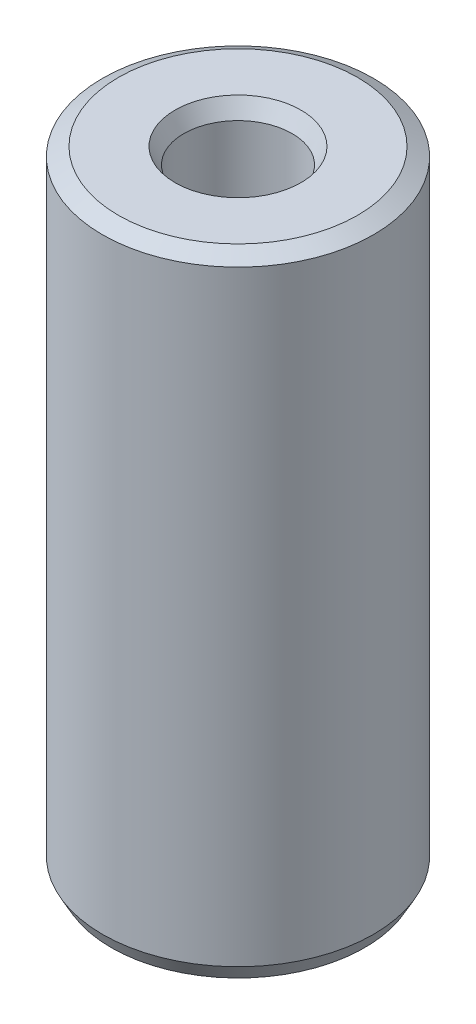
ISO-10303-21;
HEADER;
FILE_DESCRIPTION(('STEP AP214'),'2;1');
FILE_NAME('part.step','',(''),(''),'','','');
FILE_SCHEMA(('AUTOMOTIVE_DESIGN { 1 0 10303 214 1 1 1 1 }'));
ENDSEC;
DATA;
#1=APPLICATION_CONTEXT('core data for automotive mechanical design processes');
#2=APPLICATION_PROTOCOL_DEFINITION('international standard','automotive_design',2000,#1);
#3=PRODUCT_CONTEXT('',#1,'mechanical');
#4=PRODUCT('Part','Part','',(#3));
#5=PRODUCT_RELATED_PRODUCT_CATEGORY('part','',(#4));
#6=PRODUCT_DEFINITION_FORMATION('','',#4);
#7=PRODUCT_DEFINITION_CONTEXT('part definition',#1,'design');
#8=PRODUCT_DEFINITION('design','',#6,#7);
#9=PRODUCT_DEFINITION_SHAPE('','',#8);
#10=(LENGTH_UNIT() NAMED_UNIT(*) SI_UNIT(.MILLI.,.METRE.));
#11=(NAMED_UNIT(*) PLANE_ANGLE_UNIT() SI_UNIT($,.RADIAN.));
#12=(NAMED_UNIT(*) SI_UNIT($,.STERADIAN.) SOLID_ANGLE_UNIT());
#13=UNCERTAINTY_MEASURE_WITH_UNIT(LENGTH_MEASURE(1.E-05),#10,'distance_accuracy_value','');
#14=(GEOMETRIC_REPRESENTATION_CONTEXT(3) GLOBAL_UNCERTAINTY_ASSIGNED_CONTEXT((#13)) GLOBAL_UNIT_ASSIGNED_CONTEXT((#10,
#11,#12)) REPRESENTATION_CONTEXT('',''));
#15=CARTESIAN_POINT('',(0.,0.,0.));
#16=DIRECTION('',(0.,0.,1.));
#17=DIRECTION('',(1.,0.,0.));
#18=AXIS2_PLACEMENT_3D('',#15,#16,#17);
#19=CARTESIAN_POINT('',(0.,93.0772227262,0.));
#20=DIRECTION('',(0.,-1.,0.));
#21=DIRECTION('',(0.,0.,-1.));
#22=AXIS2_PLACEMENT_3D('',#19,#20,#21);
#23=CYLINDRICAL_SURFACE('',#22,20.);
#24=CARTESIAN_POINT('',(0.,2.35783132583067,0.));
#25=DIRECTION('',(0.,1.,0.));
#26=DIRECTION('',(0.,0.,1.));
#27=AXIS2_PLACEMENT_3D('',#24,#25,#26);
#28=CIRCLE('',#27,20.);
#29=CARTESIAN_POINT('',(0.,2.35783132583067,20.));
#30=VERTEX_POINT('',#29);
#31=EDGE_CURVE('E10',#30,#30,#28,.T.);
#32=ORIENTED_EDGE('',*,*,#31,.T.);
#33=EDGE_LOOP('',(#32));
#34=FACE_BOUND('',#33,.T.);
#35=CARTESIAN_POINT('',(0.,91.7779759956673,0.));
#36=DIRECTION('',(0.,1.,0.));
#37=DIRECTION('',(0.,0.,1.));
#38=AXIS2_PLACEMENT_3D('',#35,#36,#37);
#39=CIRCLE('',#38,20.);
#40=CARTESIAN_POINT('',(0.,91.7779759956673,20.));
#41=VERTEX_POINT('',#40);
#42=EDGE_CURVE('E50',#41,#41,#39,.F.);
#43=ORIENTED_EDGE('',*,*,#42,.T.);
#44=EDGE_LOOP('',(#43));
#45=FACE_BOUND('',#44,.T.);
#46=ADVANCED_FACE('F39',(#34,#45),#23,.T.);
#47=CARTESIAN_POINT('',(0.,93.0772227262,0.));
#48=DIRECTION('',(0.,1.,0.));
#49=DIRECTION('',(0.,0.,1.));
#50=AXIS2_PLACEMENT_3D('',#47,#48,#49);
#51=PLANE('',#50);
#52=CARTESIAN_POINT('',(0.,93.0772227262,0.));
#53=DIRECTION('',(0.,1.,0.));
#54=DIRECTION('',(0.,0.,1.));
#55=AXIS2_PLACEMENT_3D('',#52,#53,#54);
#56=CIRCLE('',#55,9.290536503323);
#57=CARTESIAN_POINT('',(0.,93.0772227262,9.290536503323));
#58=VERTEX_POINT('',#57);
#59=EDGE_CURVE('E58',#58,#58,#56,.F.);
#60=ORIENTED_EDGE('',*,*,#59,.T.);
#61=EDGE_LOOP('',(#60));
#62=FACE_BOUND('',#61,.T.);
#63=CARTESIAN_POINT('',(0.,93.0772227262,0.));
#64=DIRECTION('',(0.,1.,0.));
#65=DIRECTION('',(0.,0.,1.));
#66=AXIS2_PLACEMENT_3D('',#63,#64,#65);
#67=CIRCLE('',#66,17.6421686741694);
#68=CARTESIAN_POINT('',(0.,93.0772227262,17.6421686741694));
#69=VERTEX_POINT('',#68);
#70=EDGE_CURVE('E61',#69,#69,#67,.T.);
#71=ORIENTED_EDGE('',*,*,#70,.T.);
#72=EDGE_LOOP('',(#71));
#73=FACE_BOUND('',#72,.T.);
#74=ADVANCED_FACE('F88',(#62,#73),#51,.T.);
#75=CARTESIAN_POINT('',(0.,0.,0.));
#76=DIRECTION('',(0.,1.,0.));
#77=DIRECTION('',(0.,0.,1.));
#78=AXIS2_PLACEMENT_3D('',#75,#76,#77);
#79=PLANE('',#78);
#80=CARTESIAN_POINT('',(0.,0.,0.));
#81=DIRECTION('',(0.,1.,0.));
#82=DIRECTION('',(0.,0.,1.));
#83=AXIS2_PLACEMENT_3D('',#80,#81,#82);
#84=CIRCLE('',#83,10.3491210986209);
#85=CARTESIAN_POINT('',(0.,0.,-10.3491210986209));
#86=VERTEX_POINT('',#85);
#87=EDGE_CURVE('E51',#86,#86,#84,.T.);
#88=ORIENTED_EDGE('',*,*,#87,.T.);
#89=EDGE_LOOP('',(#88));
#90=FACE_BOUND('',#89,.T.);
#91=CARTESIAN_POINT('',(0.,0.,0.));
#92=DIRECTION('',(0.,1.,0.));
#93=DIRECTION('',(0.,0.,1.));
#94=AXIS2_PLACEMENT_3D('',#91,#92,#93);
#95=CIRCLE('',#94,18.7007532694673);
#96=CARTESIAN_POINT('',(0.,0.,18.7007532694673));
#97=VERTEX_POINT('',#96);
#98=EDGE_CURVE('E54',#97,#97,#95,.F.);
#99=ORIENTED_EDGE('',*,*,#98,.T.);
#100=EDGE_LOOP('',(#99));
#101=FACE_BOUND('',#100,.T.);
#102=ADVANCED_FACE('F83',(#90,#101),#79,.F.);
#103=CARTESIAN_POINT('',(0.,93.0772227262,0.));
#104=DIRECTION('',(0.,-1.,0.));
#105=DIRECTION('',(0.,0.,-1.));
#106=AXIS2_PLACEMENT_3D('',#103,#104,#105);
#107=CYLINDRICAL_SURFACE('',#106,7.99128977279031);
#108=CARTESIAN_POINT('',(0.,90.7193914003693,0.));
#109=DIRECTION('',(0.,1.,0.));
#110=DIRECTION('',(0.,0.,1.));
#111=AXIS2_PLACEMENT_3D('',#108,#109,#110);
#112=CIRCLE('',#111,7.99128977279031);
#113=CARTESIAN_POINT('',(0.,90.7193914003693,7.99128977279031));
#114=VERTEX_POINT('',#113);
#115=EDGE_CURVE('E67',#114,#114,#112,.T.);
#116=ORIENTED_EDGE('',*,*,#115,.T.);
#117=EDGE_LOOP('',(#116));
#118=FACE_BOUND('',#117,.T.);
#119=CARTESIAN_POINT('',(0.,1.29924673053269,0.));
#120=DIRECTION('',(0.,1.,0.));
#121=DIRECTION('',(0.,0.,1.));
#122=AXIS2_PLACEMENT_3D('',#119,#120,#121);
#123=CIRCLE('',#122,7.99128977279031);
#124=CARTESIAN_POINT('',(0.,1.29924673053269,-7.99128977279031));
#125=VERTEX_POINT('',#124);
#126=EDGE_CURVE('E69',#125,#125,#123,.F.);
#127=ORIENTED_EDGE('',*,*,#126,.T.);
#128=EDGE_LOOP('',(#127));
#129=FACE_BOUND('',#128,.T.);
#130=ADVANCED_FACE('F71',(#118,#129),#107,.F.);
#131=CARTESIAN_POINT('',(0.,90.7193914003693,0.));
#132=DIRECTION('',(0.,1.,0.));
#133=DIRECTION('',(0.,0.,1.));
#134=AXIS2_PLACEMENT_3D('',#131,#132,#133);
#135=CONICAL_SURFACE('',#134,7.99128977279031,0.503637211478975);
#136=ORIENTED_EDGE('',*,*,#59,.F.);
#137=EDGE_LOOP('',(#136));
#138=FACE_BOUND('',#137,.T.);
#139=ORIENTED_EDGE('',*,*,#115,.F.);
#140=EDGE_LOOP('',(#139));
#141=FACE_BOUND('',#140,.T.);
#142=ADVANCED_FACE('F77',(#138,#141),#135,.F.);
#143=CARTESIAN_POINT('',(0.,0.,0.));
#144=DIRECTION('',(0.,-1.,0.));
#145=DIRECTION('',(0.,0.,-1.));
#146=AXIS2_PLACEMENT_3D('',#143,#144,#145);
#147=CONICAL_SURFACE('',#146,10.3491210986209,1.06715911531592);
#148=CARTESIAN_POINT('',(0.,1.29924673053269,-7.99128977279031));
#149=CARTESIAN_POINT('',(0.,1.28571291042298,-8.01585051576771));
#150=CARTESIAN_POINT('',(0.,1.27217909031326,-8.04041125874511));
#151=CARTESIAN_POINT('',(0.,1.24511145009383,-8.08953274469992));
#152=CARTESIAN_POINT('',(0.,1.23157762998412,-8.11409348767732));
#153=CARTESIAN_POINT('',(0.,1.20450998976468,-8.16321497363212));
#154=CARTESIAN_POINT('',(0.,1.19097616965497,-8.18777571660953));
#155=CARTESIAN_POINT('',(0.,1.16390852943554,-8.23689720256433));
#156=CARTESIAN_POINT('',(0.,1.15037470932582,-8.26145794554173));
#157=CARTESIAN_POINT('',(0.,1.12330706910639,-8.31057943149654));
#158=CARTESIAN_POINT('',(0.,1.10977324899668,-8.33514017447394));
#159=CARTESIAN_POINT('',(0.,1.08270560877724,-8.38426166042875));
#160=CARTESIAN_POINT('',(0.,1.06917178866753,-8.40882240340615));
#161=CARTESIAN_POINT('',(0.,1.0421041484481,-8.45794388936095));
#162=CARTESIAN_POINT('',(0.,1.02857032833838,-8.48250463233836));
#163=CARTESIAN_POINT('',(0.,1.00150268811895,-8.53162611829316));
#164=CARTESIAN_POINT('',(0.,0.987968868009236,-8.55618686127056));
#165=CARTESIAN_POINT('',(0.,0.960901227789805,-8.60530834722537));
#166=CARTESIAN_POINT('',(0.,0.947367407680089,-8.62986909020277));
#167=CARTESIAN_POINT('',(0.,0.920299767460658,-8.67899057615758));
#168=CARTESIAN_POINT('',(0.,0.906765947350942,-8.70355131913498));
#169=CARTESIAN_POINT('',(0.,0.879698307131511,-8.75267280508978));
#170=CARTESIAN_POINT('',(0.,0.866164487021796,-8.77723354806719));
#171=CARTESIAN_POINT('',(0.,0.839096846802365,-8.82635503402199));
#172=CARTESIAN_POINT('',(0.,0.825563026692649,-8.8509157769994));
#173=CARTESIAN_POINT('',(0.,0.798495386473218,-8.9000372629542));
#174=CARTESIAN_POINT('',(0.,0.784961566363502,-8.9245980059316));
#175=CARTESIAN_POINT('',(0.,0.757893926144071,-8.97371949188641));
#176=CARTESIAN_POINT('',(0.,0.744360106034356,-8.99828023486381));
#177=CARTESIAN_POINT('',(0.,0.717292465814924,-9.04740172081861));
#178=CARTESIAN_POINT('',(0.,0.703758645705209,-9.07196246379602));
#179=CARTESIAN_POINT('',(0.,0.676691005485778,-9.12108394975082));
#180=CARTESIAN_POINT('',(0.,0.663157185376062,-9.14564469272823));
#181=CARTESIAN_POINT('',(0.,0.636089545156631,-9.19476617868303));
#182=CARTESIAN_POINT('',(0.,0.622555725046915,-9.21932692166043));
#183=CARTESIAN_POINT('',(0.,0.595488084827484,-9.26844840761524));
#184=CARTESIAN_POINT('',(0.,0.581954264717769,-9.29300915059264));
#185=CARTESIAN_POINT('',(0.,0.554886624498338,-9.34213063654744));
#186=CARTESIAN_POINT('',(0.,0.541352804388622,-9.36669137952485));
#187=CARTESIAN_POINT('',(0.,0.514285164169191,-9.41581286547965));
#188=CARTESIAN_POINT('',(0.,0.500751344059476,-9.44037360845705));
#189=CARTESIAN_POINT('',(0.,0.473683703840045,-9.48949509441186));
#190=CARTESIAN_POINT('',(0.,0.460149883730329,-9.51405583738926));
#191=CARTESIAN_POINT('',(0.,0.433082243510898,-9.56317732334407));
#192=CARTESIAN_POINT('',(0.,0.419548423401182,-9.58773806632147));
#193=CARTESIAN_POINT('',(0.,0.392480783181751,-9.63685955227627));
#194=CARTESIAN_POINT('',(0.,0.378946963072036,-9.66142029525368));
#195=CARTESIAN_POINT('',(0.,0.351879322852604,-9.71054178120848));
#196=CARTESIAN_POINT('',(0.,0.338345502742889,-9.73510252418589));
#197=CARTESIAN_POINT('',(0.,0.311277862523458,-9.78422401014069));
#198=CARTESIAN_POINT('',(0.,0.297744042413742,-9.80878475311809));
#199=CARTESIAN_POINT('',(0.,0.270676402194311,-9.8579062390729));
#200=CARTESIAN_POINT('',(0.,0.257142582084596,-9.8824669820503));
#201=CARTESIAN_POINT('',(0.,0.230074941865164,-9.9315884680051));
#202=CARTESIAN_POINT('',(0.,0.216541121755449,-9.95614921098251));
#203=CARTESIAN_POINT('',(0.,0.189473481536018,-10.0052706969373));
#204=CARTESIAN_POINT('',(0.,0.175939661426302,-10.0298314399147));
#205=CARTESIAN_POINT('',(0.,0.148872021206871,-10.0789529258695));
#206=CARTESIAN_POINT('',(0.,0.135338201097156,-10.1035136688469));
#207=CARTESIAN_POINT('',(0.,0.108270560877725,-10.1526351548017));
#208=CARTESIAN_POINT('',(0.,0.0947367407680088,-10.1771958977791));
#209=CARTESIAN_POINT('',(0.,0.0676691005485776,-10.2263173837339));
#210=CARTESIAN_POINT('',(0.,0.0541352804388622,-10.2508781267113));
#211=CARTESIAN_POINT('',(0.,0.0270676402194314,-10.2999996126661));
#212=CARTESIAN_POINT('',(0.,0.013533820109716,-10.3245603556435));
#213=CARTESIAN_POINT('',(0.,0.,-10.3491210986209));
#214=B_SPLINE_CURVE_WITH_KNOTS('',3,(#148,#149,#150,#151,#152,#153,#154,#155,#156,#157,#158,
#159,#160,#161,#162,#163,#164,#165,#166,#167,#168,#169,#170,#171,#172,#173,#174,#175,#176,#177,
#178,#179,#180,#181,#182,#183,#184,#185,#186,#187,#188,#189,#190,#191,#192,#193,#194,#195,#196,
#197,#198,#199,#200,#201,#202,#203,#204,#205,#206,#207,#208,#209,#210,#211,#212,#213),
.UNSPECIFIED.,.F.,.F.,(4,2,2,2,2,2,2,2,2,2,2,2,2,2,2,2,2,2,2,2,2,2,2,2,2,2,2,2,2,2,2,2,4),(0.,
0.0841281726966517,0.168256345393302,0.252384518089952,0.336512690786604,0.420640863483254,
0.504769036179906,0.588897208876556,0.673025381573208,0.757153554269858,0.841281726966508,
0.92540989966316,1.00953807235981,1.09366624505646,1.17779441775311,1.26192259044976,
1.34605076314641,1.43017893584306,1.51430710853972,1.59843528123637,1.68256345393302,
1.76669162662967,1.85081979932632,1.93494797202297,2.01907614471962,2.10320431741627,
2.18733249011292,2.27146066280957,2.35558883550622,2.43971700820288,2.52384518089953,
2.60797335359618,2.69210152629283),.UNSPECIFIED.);
#215=EDGE_CURVE('BSEAM73',#125,#86,#214,.T.);
#216=ORIENTED_EDGE('',*,*,#126,.F.);
#217=ORIENTED_EDGE('',*,*,#87,.F.);
#218=ORIENTED_EDGE('',*,*,#215,.T.);
#219=ORIENTED_EDGE('',*,*,#215,.F.);
#220=EDGE_LOOP('',(#216,#218,#217,#219));
#221=FACE_BOUND('',#220,.T.);
#222=ADVANCED_FACE('F73',(#221),#147,.F.);
#223=CARTESIAN_POINT('',(0.,2.35783132583067,0.));
#224=DIRECTION('',(0.,1.,0.));
#225=DIRECTION('',(0.,0.,1.));
#226=AXIS2_PLACEMENT_3D('',#223,#224,#225);
#227=CONICAL_SURFACE('',#226,20.,0.503637211478977);
#228=ORIENTED_EDGE('',*,*,#98,.F.);
#229=EDGE_LOOP('',(#228));
#230=FACE_BOUND('',#229,.T.);
#231=ORIENTED_EDGE('',*,*,#31,.F.);
#232=EDGE_LOOP('',(#231));
#233=FACE_BOUND('',#232,.T.);
#234=ADVANCED_FACE('F76',(#230,#233),#227,.T.);
#235=CARTESIAN_POINT('',(0.,93.0772227262,0.));
#236=DIRECTION('',(0.,-1.,0.));
#237=DIRECTION('',(0.,0.,-1.));
#238=AXIS2_PLACEMENT_3D('',#235,#236,#237);
#239=CONICAL_SURFACE('',#238,17.6421686741694,1.06715911531592);
#240=ORIENTED_EDGE('',*,*,#42,.F.);
#241=EDGE_LOOP('',(#240));
#242=FACE_BOUND('',#241,.T.);
#243=ORIENTED_EDGE('',*,*,#70,.F.);
#244=EDGE_LOOP('',(#243));
#245=FACE_BOUND('',#244,.T.);
#246=ADVANCED_FACE('F45',(#242,#245),#239,.T.);
#247=CLOSED_SHELL('',(#46,#74,#102,#130,#142,#222,#234,#246));
#248=MANIFOLD_SOLID_BREP('B2',#247);
#249=ADVANCED_BREP_SHAPE_REPRESENTATION('',(#18,#248),#14);
#250=SHAPE_DEFINITION_REPRESENTATION(#9,#249);
ENDSEC;
END-ISO-10303-21;
